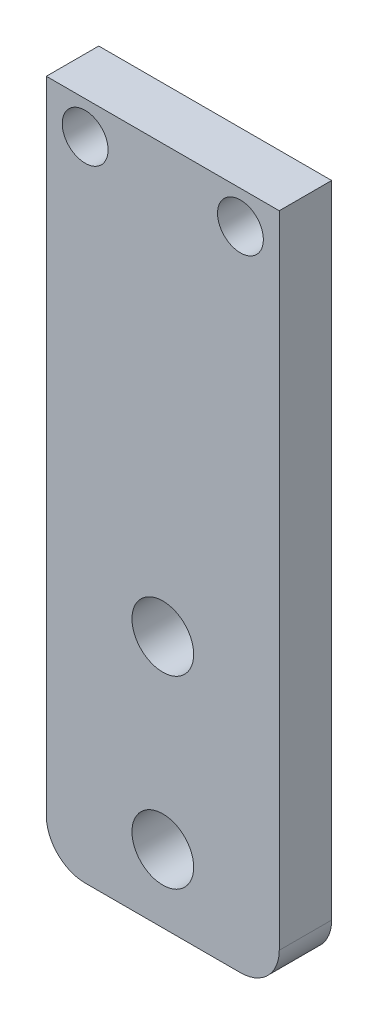
ISO-10303-21;
HEADER;
FILE_DESCRIPTION(('STEP AP214'),'2;1');
FILE_NAME('part.step','',(''),(''),'','','');
FILE_SCHEMA(('AUTOMOTIVE_DESIGN { 1 0 10303 214 1 1 1 1 }'));
ENDSEC;
DATA;
#1=APPLICATION_CONTEXT('core data for automotive mechanical design processes');
#2=APPLICATION_PROTOCOL_DEFINITION('international standard','automotive_design',2000,#1);
#3=PRODUCT_CONTEXT('',#1,'mechanical');
#4=PRODUCT('Part','Part','',(#3));
#5=PRODUCT_RELATED_PRODUCT_CATEGORY('part','',(#4));
#6=PRODUCT_DEFINITION_FORMATION('','',#4);
#7=PRODUCT_DEFINITION_CONTEXT('part definition',#1,'design');
#8=PRODUCT_DEFINITION('design','',#6,#7);
#9=PRODUCT_DEFINITION_SHAPE('','',#8);
#10=(LENGTH_UNIT() NAMED_UNIT(*) SI_UNIT(.MILLI.,.METRE.));
#11=(NAMED_UNIT(*) PLANE_ANGLE_UNIT() SI_UNIT($,.RADIAN.));
#12=(NAMED_UNIT(*) SI_UNIT($,.STERADIAN.) SOLID_ANGLE_UNIT());
#13=UNCERTAINTY_MEASURE_WITH_UNIT(LENGTH_MEASURE(1.E-05),#10,'distance_accuracy_value','');
#14=(GEOMETRIC_REPRESENTATION_CONTEXT(3) GLOBAL_UNCERTAINTY_ASSIGNED_CONTEXT((#13)) GLOBAL_UNIT_ASSIGNED_CONTEXT((#10,
#11,#12)) REPRESENTATION_CONTEXT('',''));
#15=CARTESIAN_POINT('',(0.,0.,0.));
#16=DIRECTION('',(0.,0.,1.));
#17=DIRECTION('',(1.,0.,0.));
#18=AXIS2_PLACEMENT_3D('',#15,#16,#17);
#19=CARTESIAN_POINT('',(0.,0.,3.429));
#20=DIRECTION('',(0.,0.,1.));
#21=DIRECTION('',(1.,0.,0.));
#22=AXIS2_PLACEMENT_3D('',#19,#20,#21);
#23=PLANE('',#22);
#24=CARTESIAN_POINT('',(-5.08,42.291,3.429));
#25=DIRECTION('',(0.,0.,1.));
#26=DIRECTION('',(1.,0.,0.));
#27=AXIS2_PLACEMENT_3D('',#24,#25,#26);
#28=CIRCLE('',#27,1.5);
#29=CARTESIAN_POINT('',(-3.58,42.291,3.429));
#30=VERTEX_POINT('',#29);
#31=EDGE_CURVE('E182',#30,#30,#28,.T.);
#32=ORIENTED_EDGE('',*,*,#31,.F.);
#33=EDGE_LOOP('',(#32));
#34=FACE_BOUND('',#33,.T.);
#35=CARTESIAN_POINT('',(0.,4.445,3.429));
#36=DIRECTION('',(0.,0.,1.));
#37=DIRECTION('',(1.,0.,0.));
#38=AXIS2_PLACEMENT_3D('',#35,#36,#37);
#39=CIRCLE('',#38,2.0193);
#40=CARTESIAN_POINT('',(2.0193,4.445,3.429));
#41=VERTEX_POINT('',#40);
#42=EDGE_CURVE('E130',#41,#41,#39,.T.);
#43=ORIENTED_EDGE('',*,*,#42,.F.);
#44=EDGE_LOOP('',(#43));
#45=FACE_BOUND('',#44,.T.);
#46=DIRECTION('',(1.,0.,0.));
#47=VECTOR('',#46,1.);
#48=CARTESIAN_POINT('',(-7.62,0.,3.429));
#49=LINE('',#48,#47);
#50=CARTESIAN_POINT('',(-5.08,0.,3.429));
#51=VERTEX_POINT('',#50);
#52=CARTESIAN_POINT('',(5.08,0.,3.429));
#53=VERTEX_POINT('',#52);
#54=EDGE_CURVE('E105',#51,#53,#49,.T.);
#55=ORIENTED_EDGE('',*,*,#54,.T.);
#56=CARTESIAN_POINT('',(5.08,2.54,3.429));
#57=DIRECTION('',(0.,0.,1.));
#58=DIRECTION('',(1.,0.,0.));
#59=AXIS2_PLACEMENT_3D('',#56,#57,#58);
#60=CIRCLE('',#59,2.54);
#61=CARTESIAN_POINT('',(7.62,2.54,3.429));
#62=VERTEX_POINT('',#61);
#63=EDGE_CURVE('E48',#53,#62,#60,.T.);
#64=ORIENTED_EDGE('',*,*,#63,.T.);
#65=DIRECTION('',(0.,1.,0.));
#66=VECTOR('',#65,1.);
#67=CARTESIAN_POINT('',(7.62000000000001,44.45,3.429));
#68=LINE('',#67,#66);
#69=CARTESIAN_POINT('',(7.62000000000001,44.45,3.429));
#70=VERTEX_POINT('',#69);
#71=EDGE_CURVE('E94',#62,#70,#68,.T.);
#72=ORIENTED_EDGE('',*,*,#71,.T.);
#73=DIRECTION('',(-1.,0.,0.));
#74=VECTOR('',#73,1.);
#75=CARTESIAN_POINT('',(-7.62000000000001,44.45,3.429));
#76=LINE('',#75,#74);
#77=CARTESIAN_POINT('',(-7.62000000000001,44.45,3.429));
#78=VERTEX_POINT('',#77);
#79=EDGE_CURVE('E98',#70,#78,#76,.T.);
#80=ORIENTED_EDGE('',*,*,#79,.T.);
#81=DIRECTION('',(0.,-1.,0.));
#82=VECTOR('',#81,1.);
#83=CARTESIAN_POINT('',(-7.62000000000001,44.45,3.429));
#84=LINE('',#83,#82);
#85=CARTESIAN_POINT('',(-7.62,2.54,3.429));
#86=VERTEX_POINT('',#85);
#87=EDGE_CURVE('E137',#78,#86,#84,.T.);
#88=ORIENTED_EDGE('',*,*,#87,.T.);
#89=CARTESIAN_POINT('',(-5.08,2.54,3.429));
#90=DIRECTION('',(0.,0.,1.));
#91=DIRECTION('',(1.,0.,0.));
#92=AXIS2_PLACEMENT_3D('',#89,#90,#91);
#93=CIRCLE('',#92,2.54);
#94=EDGE_CURVE('E153',#86,#51,#93,.T.);
#95=ORIENTED_EDGE('',*,*,#94,.T.);
#96=EDGE_LOOP('',(#55,#64,#72,#80,#88,#95));
#97=FACE_BOUND('',#96,.T.);
#98=CARTESIAN_POINT('',(0.,16.51,3.429));
#99=DIRECTION('',(0.,0.,1.));
#100=DIRECTION('',(1.,0.,0.));
#101=AXIS2_PLACEMENT_3D('',#98,#99,#100);
#102=CIRCLE('',#101,2.0193);
#103=CARTESIAN_POINT('',(2.0193,16.51,3.429));
#104=VERTEX_POINT('',#103);
#105=EDGE_CURVE('E174',#104,#104,#102,.T.);
#106=ORIENTED_EDGE('',*,*,#105,.F.);
#107=EDGE_LOOP('',(#106));
#108=FACE_BOUND('',#107,.T.);
#109=CARTESIAN_POINT('',(5.08,42.291,3.429));
#110=DIRECTION('',(0.,0.,1.));
#111=DIRECTION('',(1.,0.,0.));
#112=AXIS2_PLACEMENT_3D('',#109,#110,#111);
#113=CIRCLE('',#112,1.5);
#114=CARTESIAN_POINT('',(6.58,42.291,3.429));
#115=VERTEX_POINT('',#114);
#116=EDGE_CURVE('E190',#115,#115,#113,.T.);
#117=ORIENTED_EDGE('',*,*,#116,.F.);
#118=EDGE_LOOP('',(#117));
#119=FACE_BOUND('',#118,.T.);
#120=ADVANCED_FACE('F39',(#34,#45,#97,#108,#119),#23,.T.);
#121=CARTESIAN_POINT('',(0.,0.,0.));
#122=DIRECTION('',(0.,0.,1.));
#123=DIRECTION('',(1.,0.,0.));
#124=AXIS2_PLACEMENT_3D('',#121,#122,#123);
#125=PLANE('',#124);
#126=DIRECTION('',(0.,1.,0.));
#127=VECTOR('',#126,1.);
#128=CARTESIAN_POINT('',(7.62000000000001,44.45,0.));
#129=LINE('',#128,#127);
#130=CARTESIAN_POINT('',(7.62,2.54,0.));
#131=VERTEX_POINT('',#130);
#132=CARTESIAN_POINT('',(7.62000000000001,44.45,0.));
#133=VERTEX_POINT('',#132);
#134=EDGE_CURVE('E111',#131,#133,#129,.T.);
#135=ORIENTED_EDGE('',*,*,#134,.F.);
#136=CARTESIAN_POINT('',(5.08,2.54,0.));
#137=DIRECTION('',(0.,0.,1.));
#138=DIRECTION('',(1.,0.,0.));
#139=AXIS2_PLACEMENT_3D('',#136,#137,#138);
#140=CIRCLE('',#139,2.54);
#141=CARTESIAN_POINT('',(5.08,0.,0.));
#142=VERTEX_POINT('',#141);
#143=EDGE_CURVE('E144',#131,#142,#140,.F.);
#144=ORIENTED_EDGE('',*,*,#143,.T.);
#145=DIRECTION('',(1.,0.,0.));
#146=VECTOR('',#145,1.);
#147=CARTESIAN_POINT('',(-7.62,0.,0.));
#148=LINE('',#147,#146);
#149=CARTESIAN_POINT('',(-5.08,0.,0.));
#150=VERTEX_POINT('',#149);
#151=EDGE_CURVE('E129',#150,#142,#148,.T.);
#152=ORIENTED_EDGE('',*,*,#151,.F.);
#153=CARTESIAN_POINT('',(-5.08,2.54,0.));
#154=DIRECTION('',(0.,0.,1.));
#155=DIRECTION('',(1.,0.,0.));
#156=AXIS2_PLACEMENT_3D('',#153,#154,#155);
#157=CIRCLE('',#156,2.54);
#158=CARTESIAN_POINT('',(-7.62,2.54,0.));
#159=VERTEX_POINT('',#158);
#160=EDGE_CURVE('E141',#150,#159,#157,.F.);
#161=ORIENTED_EDGE('',*,*,#160,.T.);
#162=DIRECTION('',(0.,-1.,0.));
#163=VECTOR('',#162,1.);
#164=CARTESIAN_POINT('',(-7.62000000000001,44.45,0.));
#165=LINE('',#164,#163);
#166=CARTESIAN_POINT('',(-7.62000000000001,44.45,0.));
#167=VERTEX_POINT('',#166);
#168=EDGE_CURVE('E126',#167,#159,#165,.T.);
#169=ORIENTED_EDGE('',*,*,#168,.F.);
#170=DIRECTION('',(-1.,0.,0.));
#171=VECTOR('',#170,1.);
#172=CARTESIAN_POINT('',(-7.62000000000001,44.45,0.));
#173=LINE('',#172,#171);
#174=EDGE_CURVE('E135',#133,#167,#173,.T.);
#175=ORIENTED_EDGE('',*,*,#174,.F.);
#176=EDGE_LOOP('',(#135,#144,#152,#161,#169,#175));
#177=FACE_BOUND('',#176,.T.);
#178=CARTESIAN_POINT('',(0.,4.445,0.));
#179=DIRECTION('',(0.,0.,1.));
#180=DIRECTION('',(1.,0.,0.));
#181=AXIS2_PLACEMENT_3D('',#178,#179,#180);
#182=CIRCLE('',#181,2.0193);
#183=CARTESIAN_POINT('',(2.0193,4.445,0.));
#184=VERTEX_POINT('',#183);
#185=EDGE_CURVE('E170',#184,#184,#182,.T.);
#186=ORIENTED_EDGE('',*,*,#185,.T.);
#187=EDGE_LOOP('',(#186));
#188=FACE_BOUND('',#187,.T.);
#189=CARTESIAN_POINT('',(0.,16.51,0.));
#190=DIRECTION('',(0.,0.,1.));
#191=DIRECTION('',(1.,0.,0.));
#192=AXIS2_PLACEMENT_3D('',#189,#190,#191);
#193=CIRCLE('',#192,2.0193);
#194=CARTESIAN_POINT('',(2.0193,16.51,0.));
#195=VERTEX_POINT('',#194);
#196=EDGE_CURVE('E178',#195,#195,#193,.T.);
#197=ORIENTED_EDGE('',*,*,#196,.T.);
#198=EDGE_LOOP('',(#197));
#199=FACE_BOUND('',#198,.T.);
#200=CARTESIAN_POINT('',(-5.08,42.291,0.));
#201=DIRECTION('',(0.,0.,1.));
#202=DIRECTION('',(1.,0.,0.));
#203=AXIS2_PLACEMENT_3D('',#200,#201,#202);
#204=CIRCLE('',#203,1.5);
#205=CARTESIAN_POINT('',(-3.58,42.291,0.));
#206=VERTEX_POINT('',#205);
#207=EDGE_CURVE('E186',#206,#206,#204,.T.);
#208=ORIENTED_EDGE('',*,*,#207,.T.);
#209=EDGE_LOOP('',(#208));
#210=FACE_BOUND('',#209,.T.);
#211=CARTESIAN_POINT('',(5.08,42.291,0.));
#212=DIRECTION('',(0.,0.,1.));
#213=DIRECTION('',(1.,0.,0.));
#214=AXIS2_PLACEMENT_3D('',#211,#212,#213);
#215=CIRCLE('',#214,1.5);
#216=CARTESIAN_POINT('',(6.58,42.291,0.));
#217=VERTEX_POINT('',#216);
#218=EDGE_CURVE('E194',#217,#217,#215,.T.);
#219=ORIENTED_EDGE('',*,*,#218,.T.);
#220=EDGE_LOOP('',(#219));
#221=FACE_BOUND('',#220,.T.);
#222=ADVANCED_FACE('F164',(#177,#188,#199,#210,#221),#125,.F.);
#223=CARTESIAN_POINT('',(-7.62000000000001,44.45,3.429));
#224=DIRECTION('',(1.,0.,0.));
#225=DIRECTION('',(0.,1.,0.));
#226=AXIS2_PLACEMENT_3D('',#223,#224,#225);
#227=PLANE('',#226);
#228=ORIENTED_EDGE('',*,*,#168,.T.);
#229=DIRECTION('',(0.,0.,-1.));
#230=VECTOR('',#229,1.);
#231=CARTESIAN_POINT('',(-7.62,2.54,3.429));
#232=LINE('',#231,#230);
#233=EDGE_CURVE('E11',#159,#86,#232,.F.);
#234=ORIENTED_EDGE('',*,*,#233,.T.);
#235=ORIENTED_EDGE('',*,*,#87,.F.);
#236=DIRECTION('',(0.,0.,-1.));
#237=VECTOR('',#236,1.);
#238=CARTESIAN_POINT('',(-7.62000000000001,44.45,3.429));
#239=LINE('',#238,#237);
#240=EDGE_CURVE('E116',#78,#167,#239,.T.);
#241=ORIENTED_EDGE('',*,*,#240,.T.);
#242=EDGE_LOOP('',(#228,#234,#235,#241));
#243=FACE_BOUND('',#242,.T.);
#244=ADVANCED_FACE('F166',(#243),#227,.F.);
#245=CARTESIAN_POINT('',(-7.62,0.,3.429));
#246=DIRECTION('',(0.,1.,0.));
#247=DIRECTION('',(0.,0.,1.));
#248=AXIS2_PLACEMENT_3D('',#245,#246,#247);
#249=PLANE('',#248);
#250=ORIENTED_EDGE('',*,*,#151,.T.);
#251=DIRECTION('',(0.,0.,-1.));
#252=VECTOR('',#251,1.);
#253=CARTESIAN_POINT('',(5.08,0.,3.429));
#254=LINE('',#253,#252);
#255=EDGE_CURVE('E61',#142,#53,#254,.F.);
#256=ORIENTED_EDGE('',*,*,#255,.T.);
#257=ORIENTED_EDGE('',*,*,#54,.F.);
#258=DIRECTION('',(0.,0.,-1.));
#259=VECTOR('',#258,1.);
#260=CARTESIAN_POINT('',(-5.08,0.,3.429));
#261=LINE('',#260,#259);
#262=EDGE_CURVE('E147',#51,#150,#261,.T.);
#263=ORIENTED_EDGE('',*,*,#262,.T.);
#264=EDGE_LOOP('',(#250,#256,#257,#263));
#265=FACE_BOUND('',#264,.T.);
#266=ADVANCED_FACE('F159',(#265),#249,.F.);
#267=CARTESIAN_POINT('',(7.62000000000001,44.45,3.429));
#268=DIRECTION('',(-1.,0.,0.));
#269=DIRECTION('',(0.,-1.,0.));
#270=AXIS2_PLACEMENT_3D('',#267,#268,#269);
#271=PLANE('',#270);
#272=ORIENTED_EDGE('',*,*,#71,.F.);
#273=DIRECTION('',(0.,0.,-1.));
#274=VECTOR('',#273,1.);
#275=CARTESIAN_POINT('',(7.62,2.54,3.429));
#276=LINE('',#275,#274);
#277=EDGE_CURVE('E115',#62,#131,#276,.T.);
#278=ORIENTED_EDGE('',*,*,#277,.T.);
#279=ORIENTED_EDGE('',*,*,#134,.T.);
#280=DIRECTION('',(0.,0.,-1.));
#281=VECTOR('',#280,1.);
#282=CARTESIAN_POINT('',(7.62000000000001,44.45,3.429));
#283=LINE('',#282,#281);
#284=EDGE_CURVE('E108',#70,#133,#283,.T.);
#285=ORIENTED_EDGE('',*,*,#284,.F.);
#286=EDGE_LOOP('',(#272,#278,#279,#285));
#287=FACE_BOUND('',#286,.T.);
#288=ADVANCED_FACE('F109',(#287),#271,.F.);
#289=CARTESIAN_POINT('',(-7.62000000000001,44.45,3.429));
#290=DIRECTION('',(0.,-1.,0.));
#291=DIRECTION('',(0.,0.,-1.));
#292=AXIS2_PLACEMENT_3D('',#289,#290,#291);
#293=PLANE('',#292);
#294=ORIENTED_EDGE('',*,*,#174,.T.);
#295=ORIENTED_EDGE('',*,*,#240,.F.);
#296=ORIENTED_EDGE('',*,*,#79,.F.);
#297=ORIENTED_EDGE('',*,*,#284,.T.);
#298=EDGE_LOOP('',(#294,#295,#296,#297));
#299=FACE_BOUND('',#298,.T.);
#300=ADVANCED_FACE('F118',(#299),#293,.F.);
#301=CARTESIAN_POINT('',(0.,4.445,3.429));
#302=DIRECTION('',(0.,0.,-1.));
#303=DIRECTION('',(-1.,0.,0.));
#304=AXIS2_PLACEMENT_3D('',#301,#302,#303);
#305=CYLINDRICAL_SURFACE('',#304,2.0193);
#306=ORIENTED_EDGE('',*,*,#42,.T.);
#307=EDGE_LOOP('',(#306));
#308=FACE_BOUND('',#307,.T.);
#309=ORIENTED_EDGE('',*,*,#185,.F.);
#310=EDGE_LOOP('',(#309));
#311=FACE_BOUND('',#310,.T.);
#312=ADVANCED_FACE('F215',(#308,#311),#305,.F.);
#313=CARTESIAN_POINT('',(0.,16.51,3.429));
#314=DIRECTION('',(0.,0.,-1.));
#315=DIRECTION('',(-1.,0.,0.));
#316=AXIS2_PLACEMENT_3D('',#313,#314,#315);
#317=CYLINDRICAL_SURFACE('',#316,2.0193);
#318=ORIENTED_EDGE('',*,*,#105,.T.);
#319=EDGE_LOOP('',(#318));
#320=FACE_BOUND('',#319,.T.);
#321=ORIENTED_EDGE('',*,*,#196,.F.);
#322=EDGE_LOOP('',(#321));
#323=FACE_BOUND('',#322,.T.);
#324=ADVANCED_FACE('F237',(#320,#323),#317,.F.);
#325=CARTESIAN_POINT('',(-5.08,42.291,3.429));
#326=DIRECTION('',(0.,0.,-1.));
#327=DIRECTION('',(-1.,0.,0.));
#328=AXIS2_PLACEMENT_3D('',#325,#326,#327);
#329=CYLINDRICAL_SURFACE('',#328,1.5);
#330=ORIENTED_EDGE('',*,*,#31,.T.);
#331=EDGE_LOOP('',(#330));
#332=FACE_BOUND('',#331,.T.);
#333=ORIENTED_EDGE('',*,*,#207,.F.);
#334=EDGE_LOOP('',(#333));
#335=FACE_BOUND('',#334,.T.);
#336=ADVANCED_FACE('F232',(#332,#335),#329,.F.);
#337=CARTESIAN_POINT('',(5.08,42.291,3.429));
#338=DIRECTION('',(0.,0.,-1.));
#339=DIRECTION('',(-1.,0.,0.));
#340=AXIS2_PLACEMENT_3D('',#337,#338,#339);
#341=CYLINDRICAL_SURFACE('',#340,1.5);
#342=ORIENTED_EDGE('',*,*,#116,.T.);
#343=EDGE_LOOP('',(#342));
#344=FACE_BOUND('',#343,.T.);
#345=ORIENTED_EDGE('',*,*,#218,.F.);
#346=EDGE_LOOP('',(#345));
#347=FACE_BOUND('',#346,.T.);
#348=ADVANCED_FACE('F202',(#344,#347),#341,.F.);
#349=CARTESIAN_POINT('',(5.08,2.54,3.429));
#350=DIRECTION('',(0.,0.,-1.));
#351=DIRECTION('',(-1.,0.,0.));
#352=AXIS2_PLACEMENT_3D('',#349,#350,#351);
#353=CYLINDRICAL_SURFACE('',#352,2.54);
#354=ORIENTED_EDGE('',*,*,#63,.F.);
#355=ORIENTED_EDGE('',*,*,#255,.F.);
#356=ORIENTED_EDGE('',*,*,#143,.F.);
#357=ORIENTED_EDGE('',*,*,#277,.F.);
#358=EDGE_LOOP('',(#354,#355,#356,#357));
#359=FACE_BOUND('',#358,.T.);
#360=ADVANCED_FACE('F225',(#359),#353,.T.);
#361=CARTESIAN_POINT('',(-5.08,2.54,3.429));
#362=DIRECTION('',(0.,0.,-1.));
#363=DIRECTION('',(-1.,0.,0.));
#364=AXIS2_PLACEMENT_3D('',#361,#362,#363);
#365=CYLINDRICAL_SURFACE('',#364,2.54);
#366=ORIENTED_EDGE('',*,*,#94,.F.);
#367=ORIENTED_EDGE('',*,*,#233,.F.);
#368=ORIENTED_EDGE('',*,*,#160,.F.);
#369=ORIENTED_EDGE('',*,*,#262,.F.);
#370=EDGE_LOOP('',(#366,#367,#368,#369));
#371=FACE_BOUND('',#370,.T.);
#372=ADVANCED_FACE('F41',(#371),#365,.T.);
#373=CLOSED_SHELL('',(#120,#222,#244,#266,#288,#300,#312,#324,#336,#348,#360,#372));
#374=MANIFOLD_SOLID_BREP('B2',#373);
#375=ADVANCED_BREP_SHAPE_REPRESENTATION('',(#18,#374),#14);
#376=SHAPE_DEFINITION_REPRESENTATION(#9,#375);
ENDSEC;
END-ISO-10303-21;
